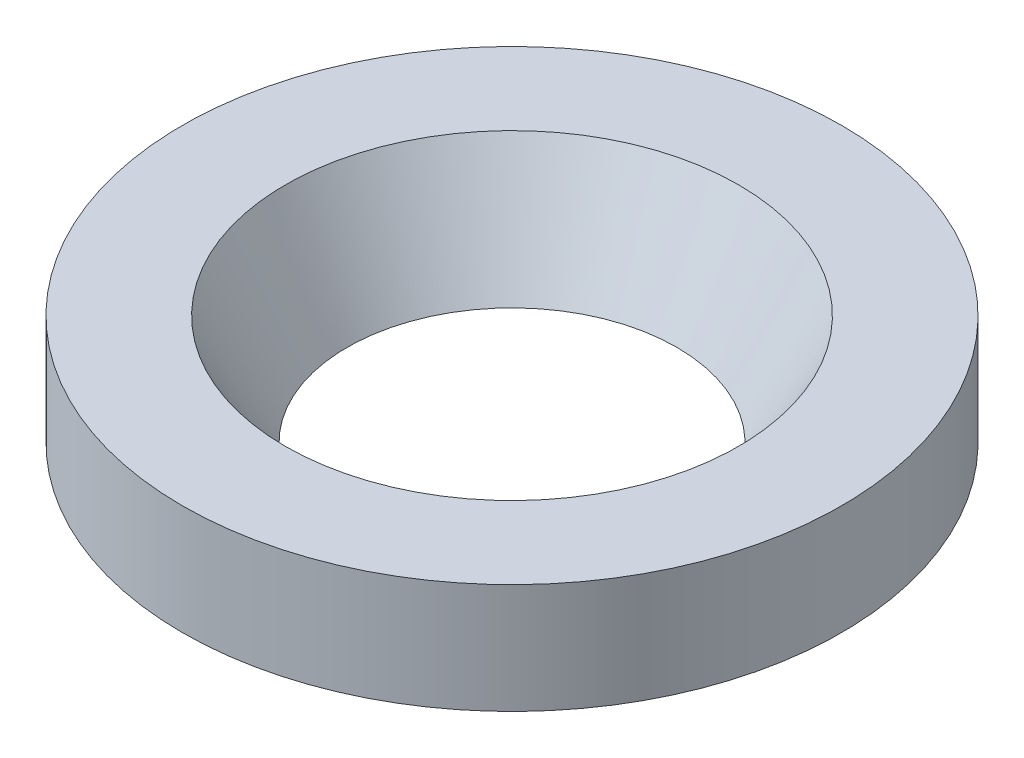
ISO-10303-21;
HEADER;
FILE_DESCRIPTION(('STEP AP214'),'2;1');
FILE_NAME('part.step','',(''),(''),'','','');
FILE_SCHEMA(('AUTOMOTIVE_DESIGN { 1 0 10303 214 1 1 1 1 }'));
ENDSEC;
DATA;
#1=APPLICATION_CONTEXT('core data for automotive mechanical design processes');
#2=APPLICATION_PROTOCOL_DEFINITION('international standard','automotive_design',2000,#1);
#3=PRODUCT_CONTEXT('',#1,'mechanical');
#4=PRODUCT('Part','Part','',(#3));
#5=PRODUCT_RELATED_PRODUCT_CATEGORY('part','',(#4));
#6=PRODUCT_DEFINITION_FORMATION('','',#4);
#7=PRODUCT_DEFINITION_CONTEXT('part definition',#1,'design');
#8=PRODUCT_DEFINITION('design','',#6,#7);
#9=PRODUCT_DEFINITION_SHAPE('','',#8);
#10=(LENGTH_UNIT() NAMED_UNIT(*) SI_UNIT(.MILLI.,.METRE.));
#11=(NAMED_UNIT(*) PLANE_ANGLE_UNIT() SI_UNIT($,.RADIAN.));
#12=(NAMED_UNIT(*) SI_UNIT($,.STERADIAN.) SOLID_ANGLE_UNIT());
#13=UNCERTAINTY_MEASURE_WITH_UNIT(LENGTH_MEASURE(1.E-05),#10,'distance_accuracy_value','');
#14=(GEOMETRIC_REPRESENTATION_CONTEXT(3) GLOBAL_UNCERTAINTY_ASSIGNED_CONTEXT((#13)) GLOBAL_UNIT_ASSIGNED_CONTEXT((#10,
#11,#12)) REPRESENTATION_CONTEXT('',''));
#15=CARTESIAN_POINT('',(0.,0.,0.));
#16=DIRECTION('',(0.,0.,1.));
#17=DIRECTION('',(1.,0.,0.));
#18=AXIS2_PLACEMENT_3D('',#15,#16,#17);
#19=CARTESIAN_POINT('',(0.,2.,0.));
#20=DIRECTION('',(0.,1.,0.));
#21=DIRECTION('',(0.,0.,1.));
#22=AXIS2_PLACEMENT_3D('',#19,#20,#21);
#23=PLANE('',#22);
#24=CARTESIAN_POINT('',(0.,2.,0.));
#25=DIRECTION('',(0.,1.,0.));
#26=DIRECTION('',(0.,0.,1.));
#27=AXIS2_PLACEMENT_3D('',#24,#25,#26);
#28=CIRCLE('',#27,4.125);
#29=CARTESIAN_POINT('',(0.,2.,4.125));
#30=VERTEX_POINT('',#29);
#31=EDGE_CURVE('E10',#30,#30,#28,.F.);
#32=ORIENTED_EDGE('',*,*,#31,.T.);
#33=EDGE_LOOP('',(#32));
#34=FACE_BOUND('',#33,.T.);
#35=CARTESIAN_POINT('',(0.,2.,0.));
#36=DIRECTION('',(0.,1.,0.));
#37=DIRECTION('',(0.,0.,1.));
#38=AXIS2_PLACEMENT_3D('',#35,#36,#37);
#39=CIRCLE('',#38,6.);
#40=CARTESIAN_POINT('',(0.,2.,6.));
#41=VERTEX_POINT('',#40);
#42=EDGE_CURVE('E48',#41,#41,#39,.T.);
#43=ORIENTED_EDGE('',*,*,#42,.T.);
#44=EDGE_LOOP('',(#43));
#45=FACE_BOUND('',#44,.T.);
#46=ADVANCED_FACE('F39',(#34,#45),#23,.T.);
#47=CARTESIAN_POINT('',(0.,0.,0.));
#48=DIRECTION('',(0.,1.,0.));
#49=DIRECTION('',(0.,0.,1.));
#50=AXIS2_PLACEMENT_3D('',#47,#48,#49);
#51=PLANE('',#50);
#52=CARTESIAN_POINT('',(0.,0.,0.));
#53=DIRECTION('',(0.,1.,0.));
#54=DIRECTION('',(0.,0.,1.));
#55=AXIS2_PLACEMENT_3D('',#52,#53,#54);
#56=CIRCLE('',#55,6.);
#57=CARTESIAN_POINT('',(0.,0.,6.));
#58=VERTEX_POINT('',#57);
#59=EDGE_CURVE('E53',#58,#58,#56,.T.);
#60=ORIENTED_EDGE('',*,*,#59,.F.);
#61=EDGE_LOOP('',(#60));
#62=FACE_BOUND('',#61,.T.);
#63=CARTESIAN_POINT('',(0.,0.,0.));
#64=DIRECTION('',(0.,1.,0.));
#65=DIRECTION('',(0.,0.,1.));
#66=AXIS2_PLACEMENT_3D('',#63,#64,#65);
#67=CIRCLE('',#66,3.);
#68=CARTESIAN_POINT('',(0.,0.,3.));
#69=VERTEX_POINT('',#68);
#70=EDGE_CURVE('E59',#69,#69,#67,.T.);
#71=ORIENTED_EDGE('',*,*,#70,.T.);
#72=EDGE_LOOP('',(#71));
#73=FACE_BOUND('',#72,.T.);
#74=ADVANCED_FACE('F65',(#62,#73),#51,.F.);
#75=CARTESIAN_POINT('',(0.,2.,0.));
#76=DIRECTION('',(0.,-1.,0.));
#77=DIRECTION('',(0.,0.,-1.));
#78=AXIS2_PLACEMENT_3D('',#75,#76,#77);
#79=CYLINDRICAL_SURFACE('',#78,6.);
#80=ORIENTED_EDGE('',*,*,#42,.F.);
#81=EDGE_LOOP('',(#80));
#82=FACE_BOUND('',#81,.T.);
#83=ORIENTED_EDGE('',*,*,#59,.T.);
#84=EDGE_LOOP('',(#83));
#85=FACE_BOUND('',#84,.T.);
#86=ADVANCED_FACE('F68',(#82,#85),#79,.T.);
#87=CARTESIAN_POINT('',(0.,0.,0.));
#88=DIRECTION('',(0.,1.,0.));
#89=DIRECTION('',(0.,0.,1.));
#90=AXIS2_PLACEMENT_3D('',#87,#88,#89);
#91=CONICAL_SURFACE('',#90,3.,0.512389460310735);
#92=ORIENTED_EDGE('',*,*,#31,.F.);
#93=EDGE_LOOP('',(#92));
#94=FACE_BOUND('',#93,.T.);
#95=ORIENTED_EDGE('',*,*,#70,.F.);
#96=EDGE_LOOP('',(#95));
#97=FACE_BOUND('',#96,.T.);
#98=ADVANCED_FACE('F42',(#94,#97),#91,.F.);
#99=CLOSED_SHELL('',(#46,#74,#86,#98));
#100=MANIFOLD_SOLID_BREP('B2',#99);
#101=ADVANCED_BREP_SHAPE_REPRESENTATION('',(#18,#100),#14);
#102=SHAPE_DEFINITION_REPRESENTATION(#9,#101);
ENDSEC;
END-ISO-10303-21;
